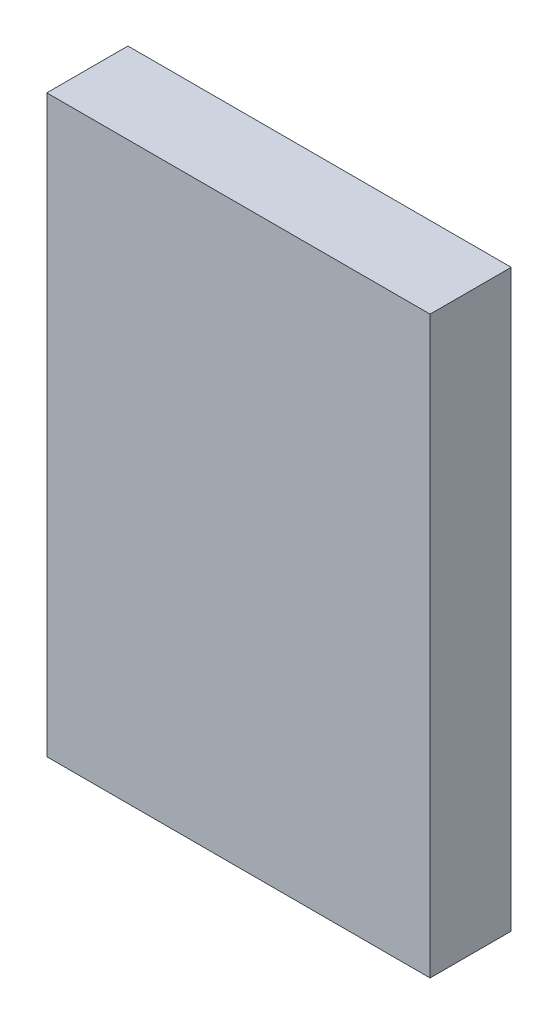
ISO-10303-21;
HEADER;
FILE_DESCRIPTION(('STEP AP214'),'2;1');
FILE_NAME('part.step','',(''),(''),'','','');
FILE_SCHEMA(('AUTOMOTIVE_DESIGN { 1 0 10303 214 1 1 1 1 }'));
ENDSEC;
DATA;
#1=APPLICATION_CONTEXT('core data for automotive mechanical design processes');
#2=APPLICATION_PROTOCOL_DEFINITION('international standard','automotive_design',2000,#1);
#3=PRODUCT_CONTEXT('',#1,'mechanical');
#4=PRODUCT('Part','Part','',(#3));
#5=PRODUCT_RELATED_PRODUCT_CATEGORY('part','',(#4));
#6=PRODUCT_DEFINITION_FORMATION('','',#4);
#7=PRODUCT_DEFINITION_CONTEXT('part definition',#1,'design');
#8=PRODUCT_DEFINITION('design','',#6,#7);
#9=PRODUCT_DEFINITION_SHAPE('','',#8);
#10=(LENGTH_UNIT() NAMED_UNIT(*) SI_UNIT(.MILLI.,.METRE.));
#11=(NAMED_UNIT(*) PLANE_ANGLE_UNIT() SI_UNIT($,.RADIAN.));
#12=(NAMED_UNIT(*) SI_UNIT($,.STERADIAN.) SOLID_ANGLE_UNIT());
#13=UNCERTAINTY_MEASURE_WITH_UNIT(LENGTH_MEASURE(1.E-05),#10,'distance_accuracy_value','');
#14=(GEOMETRIC_REPRESENTATION_CONTEXT(3) GLOBAL_UNCERTAINTY_ASSIGNED_CONTEXT((#13)) GLOBAL_UNIT_ASSIGNED_CONTEXT((#10,
#11,#12)) REPRESENTATION_CONTEXT('',''));
#15=CARTESIAN_POINT('',(0.,0.,0.));
#16=DIRECTION('',(0.,0.,1.));
#17=DIRECTION('',(1.,0.,0.));
#18=AXIS2_PLACEMENT_3D('',#15,#16,#17);
#19=CARTESIAN_POINT('',(0.,0.,6.35));
#20=DIRECTION('',(1.,0.,0.));
#21=DIRECTION('',(0.,1.,0.));
#22=AXIS2_PLACEMENT_3D('',#19,#20,#21);
#23=PLANE('',#22);
#24=DIRECTION('',(0.,-1.,0.));
#25=VECTOR('',#24,1.);
#26=CARTESIAN_POINT('',(0.,0.,0.));
#27=LINE('',#26,#25);
#28=CARTESIAN_POINT('',(0.,45.,0.));
#29=VERTEX_POINT('',#28);
#30=CARTESIAN_POINT('',(0.,0.,0.));
#31=VERTEX_POINT('',#30);
#32=EDGE_CURVE('E96',#29,#31,#27,.T.);
#33=ORIENTED_EDGE('',*,*,#32,.T.);
#34=DIRECTION('',(0.,0.,-1.));
#35=VECTOR('',#34,1.);
#36=CARTESIAN_POINT('',(0.,0.,6.35));
#37=LINE('',#36,#35);
#38=CARTESIAN_POINT('',(0.,0.,6.35));
#39=VERTEX_POINT('',#38);
#40=EDGE_CURVE('E11',#39,#31,#37,.T.);
#41=ORIENTED_EDGE('',*,*,#40,.F.);
#42=DIRECTION('',(0.,-1.,0.));
#43=VECTOR('',#42,1.);
#44=CARTESIAN_POINT('',(0.,0.,6.35));
#45=LINE('',#44,#43);
#46=CARTESIAN_POINT('',(0.,45.,6.35));
#47=VERTEX_POINT('',#46);
#48=EDGE_CURVE('E84',#47,#39,#45,.T.);
#49=ORIENTED_EDGE('',*,*,#48,.F.);
#50=DIRECTION('',(0.,0.,-1.));
#51=VECTOR('',#50,1.);
#52=CARTESIAN_POINT('',(0.,45.,6.35));
#53=LINE('',#52,#51);
#54=EDGE_CURVE('E92',#47,#29,#53,.T.);
#55=ORIENTED_EDGE('',*,*,#54,.T.);
#56=EDGE_LOOP('',(#33,#41,#49,#55));
#57=FACE_BOUND('',#56,.T.);
#58=ADVANCED_FACE('F33',(#57),#23,.F.);
#59=CARTESIAN_POINT('',(0.,0.,6.35));
#60=DIRECTION('',(0.,1.,0.));
#61=DIRECTION('',(0.,0.,1.));
#62=AXIS2_PLACEMENT_3D('',#59,#60,#61);
#63=PLANE('',#62);
#64=DIRECTION('',(1.,0.,0.));
#65=VECTOR('',#64,1.);
#66=CARTESIAN_POINT('',(0.,0.,0.));
#67=LINE('',#66,#65);
#68=CARTESIAN_POINT('',(30.,0.,0.));
#69=VERTEX_POINT('',#68);
#70=EDGE_CURVE('E88',#31,#69,#67,.T.);
#71=ORIENTED_EDGE('',*,*,#70,.T.);
#72=DIRECTION('',(0.,0.,-1.));
#73=VECTOR('',#72,1.);
#74=CARTESIAN_POINT('',(30.,0.,6.35));
#75=LINE('',#74,#73);
#76=CARTESIAN_POINT('',(30.,0.,6.35));
#77=VERTEX_POINT('',#76);
#78=EDGE_CURVE('E41',#77,#69,#75,.T.);
#79=ORIENTED_EDGE('',*,*,#78,.F.);
#80=DIRECTION('',(1.,0.,0.));
#81=VECTOR('',#80,1.);
#82=CARTESIAN_POINT('',(0.,0.,6.35));
#83=LINE('',#82,#81);
#84=EDGE_CURVE('E79',#39,#77,#83,.T.);
#85=ORIENTED_EDGE('',*,*,#84,.F.);
#86=ORIENTED_EDGE('',*,*,#40,.T.);
#87=EDGE_LOOP('',(#71,#79,#85,#86));
#88=FACE_BOUND('',#87,.T.);
#89=ADVANCED_FACE('F87',(#88),#63,.F.);
#90=CARTESIAN_POINT('',(30.,0.,6.35));
#91=DIRECTION('',(-1.,0.,0.));
#92=DIRECTION('',(0.,-1.,0.));
#93=AXIS2_PLACEMENT_3D('',#90,#91,#92);
#94=PLANE('',#93);
#95=DIRECTION('',(0.,1.,0.));
#96=VECTOR('',#95,1.);
#97=CARTESIAN_POINT('',(30.,0.,0.));
#98=LINE('',#97,#96);
#99=CARTESIAN_POINT('',(30.,45.,0.));
#100=VERTEX_POINT('',#99);
#101=EDGE_CURVE('E66',#69,#100,#98,.T.);
#102=ORIENTED_EDGE('',*,*,#101,.T.);
#103=DIRECTION('',(0.,0.,-1.));
#104=VECTOR('',#103,1.);
#105=CARTESIAN_POINT('',(30.,45.,6.35));
#106=LINE('',#105,#104);
#107=CARTESIAN_POINT('',(30.,45.,6.35));
#108=VERTEX_POINT('',#107);
#109=EDGE_CURVE('E89',#108,#100,#106,.T.);
#110=ORIENTED_EDGE('',*,*,#109,.F.);
#111=DIRECTION('',(0.,1.,0.));
#112=VECTOR('',#111,1.);
#113=CARTESIAN_POINT('',(30.,0.,6.35));
#114=LINE('',#113,#112);
#115=EDGE_CURVE('E82',#77,#108,#114,.T.);
#116=ORIENTED_EDGE('',*,*,#115,.F.);
#117=ORIENTED_EDGE('',*,*,#78,.T.);
#118=EDGE_LOOP('',(#102,#110,#116,#117));
#119=FACE_BOUND('',#118,.T.);
#120=ADVANCED_FACE('F90',(#119),#94,.F.);
#121=CARTESIAN_POINT('',(0.,45.,6.35));
#122=DIRECTION('',(0.,-1.,0.));
#123=DIRECTION('',(0.,0.,-1.));
#124=AXIS2_PLACEMENT_3D('',#121,#122,#123);
#125=PLANE('',#124);
#126=DIRECTION('',(-1.,0.,0.));
#127=VECTOR('',#126,1.);
#128=CARTESIAN_POINT('',(0.,45.,0.));
#129=LINE('',#128,#127);
#130=EDGE_CURVE('E72',#100,#29,#129,.T.);
#131=ORIENTED_EDGE('',*,*,#130,.T.);
#132=ORIENTED_EDGE('',*,*,#54,.F.);
#133=DIRECTION('',(-1.,0.,0.));
#134=VECTOR('',#133,1.);
#135=CARTESIAN_POINT('',(0.,45.,6.35));
#136=LINE('',#135,#134);
#137=EDGE_CURVE('E49',#108,#47,#136,.T.);
#138=ORIENTED_EDGE('',*,*,#137,.F.);
#139=ORIENTED_EDGE('',*,*,#109,.T.);
#140=EDGE_LOOP('',(#131,#132,#138,#139));
#141=FACE_BOUND('',#140,.T.);
#142=ADVANCED_FACE('F103',(#141),#125,.F.);
#143=CARTESIAN_POINT('',(0.,45.,6.35));
#144=DIRECTION('',(0.,0.,-1.));
#145=DIRECTION('',(-1.,0.,0.));
#146=AXIS2_PLACEMENT_3D('',#143,#144,#145);
#147=PLANE('',#146);
#148=ORIENTED_EDGE('',*,*,#48,.T.);
#149=ORIENTED_EDGE('',*,*,#84,.T.);
#150=ORIENTED_EDGE('',*,*,#115,.T.);
#151=ORIENTED_EDGE('',*,*,#137,.T.);
#152=EDGE_LOOP('',(#148,#149,#150,#151));
#153=FACE_BOUND('',#152,.T.);
#154=ADVANCED_FACE('F80',(#153),#147,.F.);
#155=CARTESIAN_POINT('',(0.,45.,0.));
#156=DIRECTION('',(0.,0.,-1.));
#157=DIRECTION('',(-1.,0.,0.));
#158=AXIS2_PLACEMENT_3D('',#155,#156,#157);
#159=PLANE('',#158);
#160=ORIENTED_EDGE('',*,*,#32,.F.);
#161=ORIENTED_EDGE('',*,*,#130,.F.);
#162=ORIENTED_EDGE('',*,*,#101,.F.);
#163=ORIENTED_EDGE('',*,*,#70,.F.);
#164=EDGE_LOOP('',(#160,#161,#162,#163));
#165=FACE_BOUND('',#164,.T.);
#166=ADVANCED_FACE('F106',(#165),#159,.T.);
#167=CLOSED_SHELL('',(#58,#89,#120,#142,#154,#166));
#168=MANIFOLD_SOLID_BREP('B2',#167);
#169=ADVANCED_BREP_SHAPE_REPRESENTATION('',(#18,#168),#14);
#170=SHAPE_DEFINITION_REPRESENTATION(#9,#169);
ENDSEC;
END-ISO-10303-21;
